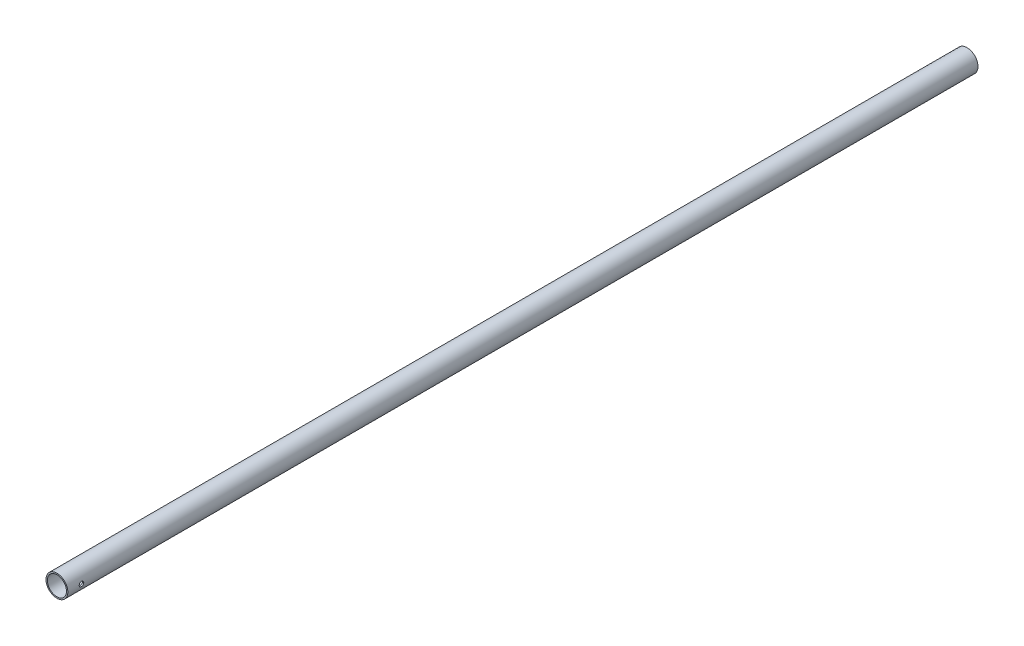
ISO-10303-21;
HEADER;
FILE_DESCRIPTION(('STEP AP214'),'2;1');
FILE_NAME('part.step','',(''),(''),'','','');
FILE_SCHEMA(('AUTOMOTIVE_DESIGN { 1 0 10303 214 1 1 1 1 }'));
ENDSEC;
DATA;
#1=APPLICATION_CONTEXT('core data for automotive mechanical design processes');
#2=APPLICATION_PROTOCOL_DEFINITION('international standard','automotive_design',2000,#1);
#3=PRODUCT_CONTEXT('',#1,'mechanical');
#4=PRODUCT('Part','Part','',(#3));
#5=PRODUCT_RELATED_PRODUCT_CATEGORY('part','',(#4));
#6=PRODUCT_DEFINITION_FORMATION('','',#4);
#7=PRODUCT_DEFINITION_CONTEXT('part definition',#1,'design');
#8=PRODUCT_DEFINITION('design','',#6,#7);
#9=PRODUCT_DEFINITION_SHAPE('','',#8);
#10=(LENGTH_UNIT() NAMED_UNIT(*) SI_UNIT(.MILLI.,.METRE.));
#11=(NAMED_UNIT(*) PLANE_ANGLE_UNIT() SI_UNIT($,.RADIAN.));
#12=(NAMED_UNIT(*) SI_UNIT($,.STERADIAN.) SOLID_ANGLE_UNIT());
#13=UNCERTAINTY_MEASURE_WITH_UNIT(LENGTH_MEASURE(1.E-05),#10,'distance_accuracy_value','');
#14=(GEOMETRIC_REPRESENTATION_CONTEXT(3) GLOBAL_UNCERTAINTY_ASSIGNED_CONTEXT((#13)) GLOBAL_UNIT_ASSIGNED_CONTEXT((#10,
#11,#12)) REPRESENTATION_CONTEXT('',''));
#15=CARTESIAN_POINT('',(0.,0.,0.));
#16=DIRECTION('',(0.,0.,1.));
#17=DIRECTION('',(1.,0.,0.));
#18=AXIS2_PLACEMENT_3D('',#15,#16,#17);
#19=CARTESIAN_POINT('',(0.,0.,2000.));
#20=DIRECTION('',(0.,0.,1.));
#21=DIRECTION('',(1.,0.,0.));
#22=AXIS2_PLACEMENT_3D('',#19,#20,#21);
#23=PLANE('',#22);
#24=CARTESIAN_POINT('',(0.,0.,2000.));
#25=DIRECTION('',(0.,0.,1.));
#26=DIRECTION('',(1.,0.,0.));
#27=AXIS2_PLACEMENT_3D('',#24,#25,#26);
#28=CIRCLE('',#27,24.);
#29=CARTESIAN_POINT('',(24.,0.,2000.));
#30=VERTEX_POINT('',#29);
#31=EDGE_CURVE('E86',#30,#30,#28,.T.);
#32=ORIENTED_EDGE('',*,*,#31,.T.);
#33=EDGE_LOOP('',(#32));
#34=FACE_BOUND('',#33,.T.);
#35=CARTESIAN_POINT('',(0.,0.,2000.));
#36=DIRECTION('',(0.,0.,1.));
#37=DIRECTION('',(1.,0.,0.));
#38=AXIS2_PLACEMENT_3D('',#35,#36,#37);
#39=CIRCLE('',#38,21.);
#40=CARTESIAN_POINT('',(21.,0.,2000.));
#41=VERTEX_POINT('',#40);
#42=EDGE_CURVE('E143',#41,#41,#39,.T.);
#43=ORIENTED_EDGE('',*,*,#42,.F.);
#44=EDGE_LOOP('',(#43));
#45=FACE_BOUND('',#44,.T.);
#46=ADVANCED_FACE('F43',(#34,#45),#23,.T.);
#47=CARTESIAN_POINT('',(0.,0.,0.));
#48=DIRECTION('',(0.,0.,1.));
#49=DIRECTION('',(1.,0.,0.));
#50=AXIS2_PLACEMENT_3D('',#47,#48,#49);
#51=PLANE('',#50);
#52=CARTESIAN_POINT('',(0.,0.,0.));
#53=DIRECTION('',(0.,0.,1.));
#54=DIRECTION('',(1.,0.,0.));
#55=AXIS2_PLACEMENT_3D('',#52,#53,#54);
#56=CIRCLE('',#55,24.);
#57=CARTESIAN_POINT('',(24.,0.,0.));
#58=VERTEX_POINT('',#57);
#59=EDGE_CURVE('E147',#58,#58,#56,.T.);
#60=ORIENTED_EDGE('',*,*,#59,.F.);
#61=EDGE_LOOP('',(#60));
#62=FACE_BOUND('',#61,.T.);
#63=CARTESIAN_POINT('',(0.,0.,0.));
#64=DIRECTION('',(0.,0.,1.));
#65=DIRECTION('',(1.,0.,0.));
#66=AXIS2_PLACEMENT_3D('',#63,#64,#65);
#67=CIRCLE('',#66,21.);
#68=CARTESIAN_POINT('',(21.,0.,0.));
#69=VERTEX_POINT('',#68);
#70=EDGE_CURVE('E141',#69,#69,#67,.T.);
#71=ORIENTED_EDGE('',*,*,#70,.T.);
#72=EDGE_LOOP('',(#71));
#73=FACE_BOUND('',#72,.T.);
#74=ADVANCED_FACE('F158',(#62,#73),#51,.F.);
#75=CARTESIAN_POINT('',(0.,0.,2000.));
#76=DIRECTION('',(0.,0.,-1.));
#77=DIRECTION('',(-1.,0.,0.));
#78=AXIS2_PLACEMENT_3D('',#75,#76,#77);
#79=CYLINDRICAL_SURFACE('',#78,24.);
#80=CARTESIAN_POINT('',(-24.,0.,1965.));
#81=CARTESIAN_POINT('',(-23.999994861066,0.277636166806643,1965.00000990988));
#82=CARTESIAN_POINT('',(-23.9951331510017,0.555395158083505,1965.02320266287));
#83=CARTESIAN_POINT('',(-23.9762080396272,1.10304526506798,1965.11527739813));
#84=CARTESIAN_POINT('',(-23.9621376475701,1.37293024051326,1965.18419409215));
#85=CARTESIAN_POINT('',(-23.9263643678479,1.89683652916537,1965.36548181969));
#86=CARTESIAN_POINT('',(-23.9046690821052,2.15087334683674,1965.477809584));
#87=CARTESIAN_POINT('',(-23.8559971123949,2.63648131442384,1965.74259843542));
#88=CARTESIAN_POINT('',(-23.8290206650411,2.86805347013733,1965.89505772462));
#89=CARTESIAN_POINT('',(-23.7723080009839,3.30556129723536,1966.23814536076));
#90=CARTESIAN_POINT('',(-23.7425402339332,3.51112097665072,1966.42924800494));
#91=CARTESIAN_POINT('',(-23.683826307706,3.8875111070776,1966.84317863678));
#92=CARTESIAN_POINT('',(-23.6548802166974,4.05833868384405,1967.06600924749));
#93=CARTESIAN_POINT('',(-23.6007777037819,4.36204126708858,1967.53980787506));
#94=CARTESIAN_POINT('',(-23.575661806879,4.49452218722571,1967.79103353801));
#95=CARTESIAN_POINT('',(-23.5325136261149,4.71524477392288,1968.31278980709));
#96=CARTESIAN_POINT('',(-23.5144805791287,4.80349120670686,1968.58331832978));
#97=CARTESIAN_POINT('',(-23.4878600390246,4.93200960535034,1969.13194094966));
#98=CARTESIAN_POINT('',(-23.4791422726772,4.97294390787021,1969.40987343732));
#99=CARTESIAN_POINT('',(-23.4717476271059,5.00773430622259,1969.96878737143));
#100=CARTESIAN_POINT('',(-23.4730696316259,5.0015956357878,1970.24976847545));
#101=CARTESIAN_POINT('',(-23.4854869731733,4.94294876148851,1970.8019241119));
#102=CARTESIAN_POINT('',(-23.4964213473049,4.89120420930899,1971.07318391865));
#103=CARTESIAN_POINT('',(-23.5265775045288,4.74402174119767,1971.60308603858));
#104=CARTESIAN_POINT('',(-23.5457997136234,4.64858157925525,1971.86172770243));
#105=CARTESIAN_POINT('',(-23.5905276585936,4.41600012855722,1972.36122891366));
#106=CARTESIAN_POINT('',(-23.6160781514313,4.27856010136955,1972.60194518611));
#107=CARTESIAN_POINT('',(-23.6705556004209,3.96609079709935,1973.05718297707));
#108=CARTESIAN_POINT('',(-23.6994829759393,3.79105684905042,1973.27170123534));
#109=CARTESIAN_POINT('',(-23.7581492371985,3.40429968618721,1973.67285584432));
#110=CARTESIAN_POINT('',(-23.7878929279795,3.19192573364843,1973.85886467559));
#111=CARTESIAN_POINT('',(-23.8443235257194,2.73866915444729,1974.19272176892));
#112=CARTESIAN_POINT('',(-23.8710103868093,2.49778610010313,1974.34056945839));
#113=CARTESIAN_POINT('',(-23.9183948377128,1.99362216494197,1974.59404032614));
#114=CARTESIAN_POINT('',(-23.9390815884104,1.73030184770608,1974.69958721827));
#115=CARTESIAN_POINT('',(-23.9720535284512,1.18913848388871,1974.86476681934));
#116=CARTESIAN_POINT('',(-23.9843398238421,0.911297354380439,1974.92440557293));
#117=CARTESIAN_POINT('',(-23.9989710086182,0.354367462803405,1974.99517700827));
#118=CARTESIAN_POINT('',(-24.0014917415031,0.0753922221047726,1975.00716776598));
#119=CARTESIAN_POINT('',(-23.996798090111,-0.480575195030815,1974.98462020012));
#120=CARTESIAN_POINT('',(-23.9895843019263,-0.757567491848998,1974.95008472559));
#121=CARTESIAN_POINT('',(-23.9663425991672,-1.29890546847923,1974.83617738612));
#122=CARTESIAN_POINT('',(-23.9504021147226,-1.56334877157681,1974.75725005847));
#123=CARTESIAN_POINT('',(-23.9114890896963,-2.07524578664535,1974.55728855831));
#124=CARTESIAN_POINT('',(-23.8885159897851,-2.32269814534715,1974.43625103654));
#125=CARTESIAN_POINT('',(-23.8376496596266,-2.79717722777394,1974.15367848705));
#126=CARTESIAN_POINT('',(-23.8096957524857,-3.02389287787918,1973.99163228172));
#127=CARTESIAN_POINT('',(-23.7521027319958,-3.44722178354609,1973.63232174769));
#128=CARTESIAN_POINT('',(-23.7224634217284,-3.64383151165344,1973.43505329792));
#129=CARTESIAN_POINT('',(-23.6642409812267,-4.00471459460678,1973.006977692));
#130=CARTESIAN_POINT('',(-23.6356835721933,-4.16839658400671,1972.77566787218));
#131=CARTESIAN_POINT('',(-23.583424040739,-4.45458876317108,1972.28833486314));
#132=CARTESIAN_POINT('',(-23.5597217161846,-4.57710066711974,1972.03231270343));
#133=CARTESIAN_POINT('',(-23.5200680279248,-4.77668985775425,1971.50415521482));
#134=CARTESIAN_POINT('',(-23.5040749099111,-4.85401239310595,1971.23211585139));
#135=CARTESIAN_POINT('',(-23.4815673870731,-4.9617615409213,1970.67853379809));
#136=CARTESIAN_POINT('',(-23.4750516263408,-4.99219486177552,1970.39699247355));
#137=CARTESIAN_POINT('',(-23.4723162924127,-5.00503705950647,1969.83834639598));
#138=CARTESIAN_POINT('',(-23.4758960918834,-4.98838170490298,1969.56126371908));
#139=CARTESIAN_POINT('',(-23.4924978890277,-4.90959621255372,1969.01394396429));
#140=CARTESIAN_POINT('',(-23.5055197960719,-4.84746651128968,1968.74370682073));
#141=CARTESIAN_POINT('',(-23.5394452982205,-4.67992871074608,1968.21840891245));
#142=CARTESIAN_POINT('',(-23.5603262804008,-4.57464470273756,1967.96330701405));
#143=CARTESIAN_POINT('',(-23.6076282294659,-4.3238982919896,1967.47424489589));
#144=CARTESIAN_POINT('',(-23.6340497105958,-4.17843215932108,1967.24028664147));
#145=CARTESIAN_POINT('',(-23.6900631820688,-3.84829478136993,1966.79551349168));
#146=CARTESIAN_POINT('',(-23.7197045547423,-3.662951561673,1966.58520350174));
#147=CARTESIAN_POINT('',(-23.7784735833223,-3.25969775246124,1966.19836202709));
#148=CARTESIAN_POINT('',(-23.8076011193935,-3.04177967533178,1966.02183832979));
#149=CARTESIAN_POINT('',(-23.8624577819072,-2.57653771003074,1965.70564570726));
#150=CARTESIAN_POINT('',(-23.8881438429302,-2.32890368608535,1965.56642528045));
#151=CARTESIAN_POINT('',(-23.9327963397633,-1.81327937599381,1965.33179908628));
#152=CARTESIAN_POINT('',(-23.9517686472839,-1.54530712762898,1965.23635501127));
#153=CARTESIAN_POINT('',(-23.9772999912578,-1.06406117160044,1965.10983888685));
#154=CARTESIAN_POINT('',(-23.9857614264558,-0.85347037491175,1965.06872494716));
#155=CARTESIAN_POINT('',(-23.9971133115903,-0.428610696706178,1965.01380218289));
#156=CARTESIAN_POINT('',(-24.0000039673834,-0.214341951395503,1964.99999234933));
#157=CARTESIAN_POINT('',(-24.,0.,1965.));
#158=B_SPLINE_CURVE_WITH_KNOTS('',3,(#80,#81,#82,#83,#84,#85,#86,#87,#88,#89,#90,#91,#92,#93,
#94,#95,#96,#97,#98,#99,#100,#101,#102,#103,#104,#105,#106,#107,#108,#109,#110,#111,#112,#113,
#114,#115,#116,#117,#118,#119,#120,#121,#122,#123,#124,#125,#126,#127,#128,#129,#130,#131,#132,
#133,#134,#135,#136,#137,#138,#139,#140,#141,#142,#143,#144,#145,#146,#147,#148,#149,#150,#151,
#152,#153,#154,#155,#156,#157),.UNSPECIFIED.,.T.,.F.,(4,2,2,2,2,2,2,2,2,2,2,2,2,2,2,2,2,2,2,2,2,
2,2,2,2,2,2,2,2,2,2,2,2,2,2,2,2,2,4),(0.,0.832124180412729,1.66488079962489,2.4968095153018,
3.32870096629195,4.1715010555248,5.01437086207161,5.86561796714188,6.71677333141967,
7.55586300682109,8.39485939074104,9.22006848521691,10.0453200012658,10.8765836967242,
11.7079507347759,12.5555810542731,13.4032240911832,14.252388980041,15.1014420418853,
15.9351335763615,16.7687740621456,17.5942114653594,18.4197145356919,19.256063359884,
20.0925101026374,20.9428505532278,21.7931555941069,22.6388020038771,23.4843274166671,
24.3131689317594,25.14200249139,25.9684692558656,26.7950127633945,27.6367609933478,
28.4787030048304,29.3303545760657,30.1812594587343,30.8237035392266,31.4661238790711),.UNSPECIFIED.);
#159=CARTESIAN_POINT('',(-24.,0.,1965.));
#160=VERTEX_POINT('',#159);
#161=EDGE_CURVE('E11',#160,#160,#158,.T.);
#162=ORIENTED_EDGE('',*,*,#161,.T.);
#163=EDGE_LOOP('',(#162));
#164=FACE_BOUND('',#163,.T.);
#165=CARTESIAN_POINT('',(23.975,-1.09515980569044,1965.12141157711));
#166=CARTESIAN_POINT('',(23.968748365967,-1.23224681427325,1965.15216920839));
#167=CARTESIAN_POINT('',(23.9613601734638,-1.36797282869042,1965.18872171484));
#168=CARTESIAN_POINT('',(23.9445654413173,-1.63574004655299,1965.27305470961));
#169=CARTESIAN_POINT('',(23.9351592198603,-1.76778182719347,1965.32083342799));
#170=CARTESIAN_POINT('',(23.9145941212787,-2.02709697468056,1965.42719949035));
#171=CARTESIAN_POINT('',(23.9034374824825,-2.15437617766581,1965.48577304703));
#172=CARTESIAN_POINT('',(23.8796771678721,-2.40346918084593,1965.61332555548));
#173=CARTESIAN_POINT('',(23.8670734668173,-2.52528288565628,1965.68230468877));
#174=CARTESIAN_POINT('',(23.8407708851503,-2.76258883052472,1965.83015074795));
#175=CARTESIAN_POINT('',(23.8270722558788,-2.87808251114835,1965.90901540696));
#176=CARTESIAN_POINT('',(23.7989505375895,-3.10204732689315,1966.07612045677));
#177=CARTESIAN_POINT('',(23.7845271826325,-3.21051585020611,1966.1643643027));
#178=CARTESIAN_POINT('',(23.7553631312298,-3.41962961918388,1966.34957057225));
#179=CARTESIAN_POINT('',(23.7406225313502,-3.52027720363007,1966.44653037058));
#180=CARTESIAN_POINT('',(23.7112221066012,-3.71314801958655,1966.64857574588));
#181=CARTESIAN_POINT('',(23.6965623137583,-3.8053681090141,1966.75366432683));
#182=CARTESIAN_POINT('',(23.6675871380506,-3.98163051804368,1966.97236926516));
#183=CARTESIAN_POINT('',(23.6532769315573,-4.06557767589029,1967.08606303196));
#184=CARTESIAN_POINT('',(23.6255674141578,-4.22362477899513,1967.3202688813));
#185=CARTESIAN_POINT('',(23.6121684452334,-4.2977210371257,1967.44078349291));
#186=CARTESIAN_POINT('',(23.5866814034978,-4.43546698124717,1967.68772525304));
#187=CARTESIAN_POINT('',(23.5745929155034,-4.4991199791453,1967.81415051069));
#188=CARTESIAN_POINT('',(23.5520748615044,-4.61554865115295,1968.07211447572));
#189=CARTESIAN_POINT('',(23.5416458997194,-4.66832036553766,1968.20365502393));
#190=CARTESIAN_POINT('',(23.5228357644798,-4.76219212213002,1968.46987006394));
#191=CARTESIAN_POINT('',(23.5144398749696,-4.80337641290026,1968.60451380235));
#192=CARTESIAN_POINT('',(23.4998449270079,-4.87427953070888,1968.87695975557));
#193=CARTESIAN_POINT('',(23.4936466943985,-4.90399404797279,1969.01476313706));
#194=CARTESIAN_POINT('',(23.4836428775968,-4.95167764236373,1969.29238851196));
#195=CARTESIAN_POINT('',(23.4798358610234,-4.969653751263,1969.43220924549));
#196=CARTESIAN_POINT('',(23.4747241238061,-4.99374409457383,1969.71297886353));
#197=CARTESIAN_POINT('',(23.4734205226039,-4.99985302240177,1969.85392822444));
#198=CARTESIAN_POINT('',(23.4733595795833,-5.00013888192353,1970.13304626217));
#199=CARTESIAN_POINT('',(23.4745523411448,-4.99454963352743,1970.27121474802));
#200=CARTESIAN_POINT('',(23.4793482060551,-4.97195544148962,1970.5465728709));
#201=CARTESIAN_POINT('',(23.4829513037698,-4.95495052453156,1970.68376251023));
#202=CARTESIAN_POINT('',(23.4924628224408,-4.90965629330215,1970.95621685878));
#203=CARTESIAN_POINT('',(23.4983717836212,-4.88136433463625,1971.09148110922));
#204=CARTESIAN_POINT('',(23.5123197416485,-4.81373145239337,1971.35905305348));
#205=CARTESIAN_POINT('',(23.5203579743977,-4.77439449205653,1971.49136178948));
#206=CARTESIAN_POINT('',(23.5383265691202,-4.6850034294787,1971.75206093542));
#207=CARTESIAN_POINT('',(23.5482554891296,-4.63495749104074,1971.88045424551));
#208=CARTESIAN_POINT('',(23.5697234201822,-4.5245219431463,1972.13251678563));
#209=CARTESIAN_POINT('',(23.5812618647075,-4.4641359714633,1972.25618765844));
#210=CARTESIAN_POINT('',(23.6056327675501,-4.3334190847166,1972.49807622108));
#211=CARTESIAN_POINT('',(23.6184656599759,-4.26308483017468,1972.61629206199));
#212=CARTESIAN_POINT('',(23.6450634771198,-4.11300098065095,1972.84641665178));
#213=CARTESIAN_POINT('',(23.65882808282,-4.03325460148688,1972.95832753565));
#214=CARTESIAN_POINT('',(23.6871916654114,-3.8632266810926,1973.17727271514));
#215=CARTESIAN_POINT('',(23.7018016544165,-3.77277062825404,1973.28417010915));
#216=CARTESIAN_POINT('',(23.7311908564335,-3.58326236986886,1973.48995555639));
#217=CARTESIAN_POINT('',(23.7459700083992,-3.48421318541332,1973.58884640104));
#218=CARTESIAN_POINT('',(23.7752993016186,-3.2781061773565,1973.77804146561));
#219=CARTESIAN_POINT('',(23.7898493291479,-3.17104451959973,1973.8683415271));
#220=CARTESIAN_POINT('',(23.8183047786326,-2.94971216993621,1974.03965047777));
#221=CARTESIAN_POINT('',(23.8322104282647,-2.83544405848619,1974.12066266376));
#222=CARTESIAN_POINT('',(23.8596726446446,-2.59450286370421,1974.27670155474));
#223=CARTESIAN_POINT('',(23.8731763476037,-2.46749485580766,1974.35122123247));
#224=CARTESIAN_POINT('',(23.8986406452392,-2.2072779948441,1974.48882960422));
#225=CARTESIAN_POINT('',(23.9106011940913,-2.07406895779523,1974.5519179588));
#226=CARTESIAN_POINT('',(23.9326247679846,-1.8022346207608,1974.66623101899));
#227=CARTESIAN_POINT('',(23.9426845745331,-1.66360060538403,1974.71743563496));
#228=CARTESIAN_POINT('',(23.960583497083,-1.38220111345897,1974.80743139323));
#229=CARTESIAN_POINT('',(23.968422301542,-1.2394350603977,1974.84622079413));
#230=CARTESIAN_POINT('',(23.975,-1.09515980569042,1974.87858842289));
#231=B_SPLINE_CURVE_WITH_KNOTS('',3,(#165,#166,#167,#168,#169,#170,#171,#172,#173,#174,#175,
#176,#177,#178,#179,#180,#181,#182,#183,#184,#185,#186,#187,#188,#189,#190,#191,#192,#193,#194,
#195,#196,#197,#198,#199,#200,#201,#202,#203,#204,#205,#206,#207,#208,#209,#210,#211,#212,#213,
#214,#215,#216,#217,#218,#219,#220,#221,#222,#223,#224,#225,#226,#227,#228,#229,#230),
.UNSPECIFIED.,.F.,.F.,(4,2,2,2,2,2,2,2,2,2,2,2,2,2,2,2,2,2,2,2,2,2,2,2,2,2,2,2,2,2,2,2,4),(0.,
0.421760901676002,0.84345535236266,1.26461489570341,1.68578178631253,2.10685227419139,
2.5280784192516,2.94917811175478,3.37043417070609,3.79607706774015,4.2218788342848,
4.64754530272413,5.07336639988133,5.49600638335769,5.91880501983602,6.34135015024872,
6.76408418444385,7.17844948311008,7.59281381321766,8.00727528010285,8.42158821684135,
8.83558642744392,9.24943928561354,9.66343139868479,10.0772824713313,10.4991701992624,
10.9209102003878,11.3428533204622,11.7646462014488,12.2076847770848,12.6507365058727,
13.0945318516913,13.538389418388),.UNSPECIFIED.);
#232=CARTESIAN_POINT('',(23.975,-1.09515980569042,1965.12141157711));
#233=VERTEX_POINT('',#232);
#234=CARTESIAN_POINT('',(23.975,-1.09515980569044,1974.87858842289));
#235=VERTEX_POINT('',#234);
#236=EDGE_CURVE('E90',#233,#235,#231,.T.);
#237=ORIENTED_EDGE('',*,*,#236,.T.);
#238=CARTESIAN_POINT('',(23.9723,-1.15275006397729,1974.8625275917));
#239=CARTESIAN_POINT('',(23.9781392979474,-1.03154200004675,1974.89728031993));
#240=CARTESIAN_POINT('',(23.9831134949393,-0.908722912885051,1974.92659818002));
#241=CARTESIAN_POINT('',(23.9912178521535,-0.660841262552903,1974.97409306981));
#242=CARTESIAN_POINT('',(23.9943472947677,-0.535777845807257,1974.99226576416));
#243=CARTESIAN_POINT('',(23.9985897867272,-0.287628883946799,1975.01685987648));
#244=CARTESIAN_POINT('',(23.999751375024,-0.16457225238678,1975.02356421408));
#245=CARTESIAN_POINT('',(24.0001768933379,0.0815889435704667,1975.02602144756));
#246=CARTESIAN_POINT('',(23.999441771824,0.204693453243416,1975.0217798171));
#247=CARTESIAN_POINT('',(23.9958746756669,0.466007863142393,1975.00113365024));
#248=CARTESIAN_POINT('',(23.9927820167069,0.604096403452712,1974.98321661937));
#249=CARTESIAN_POINT('',(23.984277492486,0.879740226087355,1974.93344397685));
#250=CARTESIAN_POINT('',(23.978832635716,1.01725871608325,1974.90138994307));
#251=CARTESIAN_POINT('',(23.9723,1.15275006397727,1974.8625275917));
#252=B_SPLINE_CURVE_WITH_KNOTS('',3,(#238,#239,#240,#241,#242,#243,#244,#245,#246,#247,#248,
#249,#250,#251),.UNSPECIFIED.,.F.,.F.,(4,2,2,2,2,2,4),(0.,0.378569501850084,0.757286169971352,
1.12651760805407,1.49556444401623,1.91268749018455,2.33586129937914),.UNSPECIFIED.);
#253=CARTESIAN_POINT('',(23.975,1.09515980569044,1974.87858842289));
#254=VERTEX_POINT('',#253);
#255=EDGE_CURVE('E59',#235,#254,#252,.T.);
#256=ORIENTED_EDGE('',*,*,#255,.T.);
#257=CARTESIAN_POINT('',(23.975,1.09515980569044,1974.87858842289));
#258=CARTESIAN_POINT('',(23.968748365967,1.23224681427325,1974.84783079161));
#259=CARTESIAN_POINT('',(23.9613601734638,1.36797282869042,1974.81127828516));
#260=CARTESIAN_POINT('',(23.9445654413173,1.63574004655299,1974.72694529039));
#261=CARTESIAN_POINT('',(23.9351592198603,1.76778182719347,1974.67916657201));
#262=CARTESIAN_POINT('',(23.9145941212787,2.02709697468056,1974.57280050965));
#263=CARTESIAN_POINT('',(23.9034374824825,2.15437617766582,1974.51422695297));
#264=CARTESIAN_POINT('',(23.8796771678721,2.40346918084593,1974.38667444452));
#265=CARTESIAN_POINT('',(23.8670734668173,2.52528288565627,1974.31769531123));
#266=CARTESIAN_POINT('',(23.8407708851503,2.76258883052468,1974.16984925205));
#267=CARTESIAN_POINT('',(23.8270722558788,2.8780825111483,1974.09098459304));
#268=CARTESIAN_POINT('',(23.7989505375895,3.1020473268931,1973.92387954323));
#269=CARTESIAN_POINT('',(23.7845271826325,3.21051585020606,1973.83563569729));
#270=CARTESIAN_POINT('',(23.7553631312298,3.41962961918397,1973.65042942775));
#271=CARTESIAN_POINT('',(23.7406225313502,3.5202772036303,1973.55346962942));
#272=CARTESIAN_POINT('',(23.7112221066011,3.71314801958678,1973.35142425412));
#273=CARTESIAN_POINT('',(23.6965623137583,3.8053681090142,1973.24633567317));
#274=CARTESIAN_POINT('',(23.6675871380506,3.9816305180437,1973.02763073484));
#275=CARTESIAN_POINT('',(23.6532769315573,4.06557767589035,1972.91393696804));
#276=CARTESIAN_POINT('',(23.6255674141578,4.22362477899518,1972.6797311187));
#277=CARTESIAN_POINT('',(23.6121684452334,4.29772103712571,1972.55921650709));
#278=CARTESIAN_POINT('',(23.5866814034978,4.4354669812472,1972.31227474696));
#279=CARTESIAN_POINT('',(23.5745929155034,4.49911997914539,1972.18584948931));
#280=CARTESIAN_POINT('',(23.5520748615044,4.61554865115303,1971.92788552428));
#281=CARTESIAN_POINT('',(23.5416458997194,4.66832036553768,1971.79634497607));
#282=CARTESIAN_POINT('',(23.5228357644798,4.7621921221301,1971.53012993606));
#283=CARTESIAN_POINT('',(23.5144398749696,4.80337641290042,1971.39548619765));
#284=CARTESIAN_POINT('',(23.4998449270078,4.87427953070906,1971.12304024443));
#285=CARTESIAN_POINT('',(23.4936466943985,4.90399404797293,1970.98523686294));
#286=CARTESIAN_POINT('',(23.4836428775968,4.95167764236381,1970.70761148804));
#287=CARTESIAN_POINT('',(23.4798358610234,4.96965375126306,1970.56779075451));
#288=CARTESIAN_POINT('',(23.4747241238061,4.99374409457384,1970.28702113647));
#289=CARTESIAN_POINT('',(23.4734205226039,4.99985302240177,1970.14607177556));
#290=CARTESIAN_POINT('',(23.4733595795833,5.00013888192353,1969.86695373783));
#291=CARTESIAN_POINT('',(23.4745523411448,4.99454963352741,1969.72878525198));
#292=CARTESIAN_POINT('',(23.4793482060551,4.97195544148958,1969.4534271291));
#293=CARTESIAN_POINT('',(23.4829513037698,4.95495052453154,1969.31623748977));
#294=CARTESIAN_POINT('',(23.4924628224408,4.90965629330218,1969.04378314122));
#295=CARTESIAN_POINT('',(23.4983717836212,4.88136433463634,1968.90851889078));
#296=CARTESIAN_POINT('',(23.5123197416485,4.81373145239349,1968.64094694652));
#297=CARTESIAN_POINT('',(23.5203579743977,4.7743944920566,1968.50863821052));
#298=CARTESIAN_POINT('',(23.5383265691202,4.6850034294787,1968.24793906458));
#299=CARTESIAN_POINT('',(23.5482554891296,4.63495749104074,1968.11954575449));
#300=CARTESIAN_POINT('',(23.5697234201822,4.52452194314631,1967.86748321437));
#301=CARTESIAN_POINT('',(23.5812618647075,4.46413597146331,1967.74381234156));
#302=CARTESIAN_POINT('',(23.60563276755,4.33341908471663,1967.50192377892));
#303=CARTESIAN_POINT('',(23.6184656599759,4.26308483017473,1967.38370793801));
#304=CARTESIAN_POINT('',(23.6450634771198,4.113000980651,1967.15358334822));
#305=CARTESIAN_POINT('',(23.65882808282,4.03325460148691,1967.04167246435));
#306=CARTESIAN_POINT('',(23.6871916654114,3.86322668109264,1966.82272728486));
#307=CARTESIAN_POINT('',(23.7018016544165,3.77277062825413,1966.71582989085));
#308=CARTESIAN_POINT('',(23.7311908564335,3.58326236986895,1966.51004444361));
#309=CARTESIAN_POINT('',(23.7459700083992,3.48421318541336,1966.41115359896));
#310=CARTESIAN_POINT('',(23.7752993016186,3.27810617735649,1966.22195853439));
#311=CARTESIAN_POINT('',(23.7898493291479,3.17104451959973,1966.1316584729));
#312=CARTESIAN_POINT('',(23.8183047786326,2.94971216993622,1965.96034952223));
#313=CARTESIAN_POINT('',(23.8322104282647,2.83544405848619,1965.87933733624));
#314=CARTESIAN_POINT('',(23.8596726446447,2.59450286370418,1965.72329844526));
#315=CARTESIAN_POINT('',(23.8731763476037,2.4674948558076,1965.64877876753));
#316=CARTESIAN_POINT('',(23.8986406452392,2.20727799484403,1965.51117039578));
#317=CARTESIAN_POINT('',(23.9106011940913,2.0740689577952,1965.4480820412));
#318=CARTESIAN_POINT('',(23.9326247679846,1.8022346207608,1965.33376898101));
#319=CARTESIAN_POINT('',(23.9426845745331,1.66360060538404,1965.28256436504));
#320=CARTESIAN_POINT('',(23.960583497083,1.38220111345897,1965.19256860677));
#321=CARTESIAN_POINT('',(23.968422301542,1.23943506039769,1965.15377920587));
#322=CARTESIAN_POINT('',(23.975,1.09515980569042,1965.12141157711));
#323=B_SPLINE_CURVE_WITH_KNOTS('',3,(#257,#258,#259,#260,#261,#262,#263,#264,#265,#266,#267,
#268,#269,#270,#271,#272,#273,#274,#275,#276,#277,#278,#279,#280,#281,#282,#283,#284,#285,#286,
#287,#288,#289,#290,#291,#292,#293,#294,#295,#296,#297,#298,#299,#300,#301,#302,#303,#304,#305,
#306,#307,#308,#309,#310,#311,#312,#313,#314,#315,#316,#317,#318,#319,#320,#321,#322),
.UNSPECIFIED.,.F.,.F.,(4,2,2,2,2,2,2,2,2,2,2,2,2,2,2,2,2,2,2,2,2,2,2,2,2,2,2,2,2,2,2,2,4),(0.,
0.421760901676002,0.84345535236266,1.26461489570341,1.68578178631253,2.10685227419118,
2.5280784192516,2.94917811175518,3.37043417070611,3.7960770677404,4.22187883428481,
4.64754530272418,5.07336639988134,5.49600638335862,5.91880501983671,6.34135015024919,
6.76408418444387,7.17844948311054,7.59281381321768,8.00727528010218,8.42158821684136,
8.83558642744394,9.24943928561355,9.66343139868457,10.0772824713313,10.4991701992623,
10.9209102003878,11.3428533204623,11.7646462014489,12.2076847770849,12.6507365058727,
13.0945318516913,13.538389418388),.UNSPECIFIED.);
#324=CARTESIAN_POINT('',(23.975,1.09515980569044,1965.12141157711));
#325=VERTEX_POINT('',#324);
#326=EDGE_CURVE('E85',#254,#325,#323,.T.);
#327=ORIENTED_EDGE('',*,*,#326,.T.);
#328=CARTESIAN_POINT('',(23.9723,1.15275006397728,1965.1374724083));
#329=CARTESIAN_POINT('',(23.9781392979474,1.03154200004673,1965.10271968007));
#330=CARTESIAN_POINT('',(23.9831134949393,0.908722912885039,1965.07340181998));
#331=CARTESIAN_POINT('',(23.9912178521535,0.660841262552891,1965.02590693019));
#332=CARTESIAN_POINT('',(23.9943472947677,0.535777845807244,1965.00773423584));
#333=CARTESIAN_POINT('',(23.9985897867272,0.287628883946785,1964.98314012352));
#334=CARTESIAN_POINT('',(23.999751375024,0.164572252386767,1964.97643578592));
#335=CARTESIAN_POINT('',(24.0001768933379,-0.0815889435704807,1964.97397855244));
#336=CARTESIAN_POINT('',(23.999441771824,-0.20469345324343,1964.9782201829));
#337=CARTESIAN_POINT('',(23.9958746756669,-0.466007863142407,1964.99886634976));
#338=CARTESIAN_POINT('',(23.9927820167069,-0.604096403452725,1965.01678338063));
#339=CARTESIAN_POINT('',(23.984277492486,-0.879740226087367,1965.06655602315));
#340=CARTESIAN_POINT('',(23.978832635716,-1.01725871608327,1965.09861005693));
#341=CARTESIAN_POINT('',(23.9723,-1.15275006397728,1965.1374724083));
#342=B_SPLINE_CURVE_WITH_KNOTS('',3,(#328,#329,#330,#331,#332,#333,#334,#335,#336,#337,#338,
#339,#340,#341),.UNSPECIFIED.,.F.,.F.,(4,2,2,2,2,2,4),(0.,0.378569501850083,0.757286169971352,
1.12651760805407,1.49556444401623,1.91268749018455,2.33586129937914),.UNSPECIFIED.);
#343=EDGE_CURVE('E79',#325,#233,#342,.T.);
#344=ORIENTED_EDGE('',*,*,#343,.T.);
#345=EDGE_LOOP('',(#237,#256,#327,#344));
#346=FACE_BOUND('',#345,.T.);
#347=ORIENTED_EDGE('',*,*,#31,.F.);
#348=EDGE_LOOP('',(#347));
#349=FACE_BOUND('',#348,.T.);
#350=ORIENTED_EDGE('',*,*,#59,.T.);
#351=EDGE_LOOP('',(#350));
#352=FACE_BOUND('',#351,.T.);
#353=ADVANCED_FACE('F45',(#164,#346,#349,#352),#79,.T.);
#354=CARTESIAN_POINT('',(0.,0.,2000.));
#355=DIRECTION('',(0.,0.,-1.));
#356=DIRECTION('',(-1.,0.,0.));
#357=AXIS2_PLACEMENT_3D('',#354,#355,#356);
#358=CYLINDRICAL_SURFACE('',#357,21.);
#359=CARTESIAN_POINT('',(-21.,0.,1975.));
#360=CARTESIAN_POINT('',(-20.9999950869177,-0.276672274558169,1974.99999151638));
#361=CARTESIAN_POINT('',(-20.9944774067901,-0.553442219138292,1974.97695835107));
#362=CARTESIAN_POINT('',(-20.9730002170211,-1.09907770151532,1974.88555542657));
#363=CARTESIAN_POINT('',(-20.9570341804966,-1.36793818865574,1974.81715732844));
#364=CARTESIAN_POINT('',(-20.9164321233986,-1.88979410561493,1974.63732205476));
#365=CARTESIAN_POINT('',(-20.8918059875511,-2.1428072374909,1974.5259339344));
#366=CARTESIAN_POINT('',(-20.8365202410985,-2.6265522751158,1974.26344658075));
#367=CARTESIAN_POINT('',(-20.8058605663621,-2.85728394399264,1974.11234692535));
#368=CARTESIAN_POINT('',(-20.7412034300524,-3.29425969068973,1973.77172133021));
#369=CARTESIAN_POINT('',(-20.7071583727605,-3.50002481652155,1973.58158995483));
#370=CARTESIAN_POINT('',(-20.6398911908242,-3.87706759367376,1973.16959568724));
#371=CARTESIAN_POINT('',(-20.6066691512673,-4.04834169208969,1972.94772953006));
#372=CARTESIAN_POINT('',(-20.5443340852451,-4.35373775975632,1972.47491504958));
#373=CARTESIAN_POINT('',(-20.5152817169505,-4.48733420931327,1972.2236185684));
#374=CARTESIAN_POINT('',(-20.4652654141857,-4.71020659981248,1971.70133277819));
#375=CARTESIAN_POINT('',(-20.4443003177035,-4.79948890851929,1971.43034630495));
#376=CARTESIAN_POINT('',(-20.4133198403067,-4.92958478368451,1970.88161222288));
#377=CARTESIAN_POINT('',(-20.4031113241091,-4.97125443618189,1970.60407872751));
#378=CARTESIAN_POINT('',(-20.3942210083979,-5.00760694890757,1970.04578700015));
#379=CARTESIAN_POINT('',(-20.3955375175525,-5.00229670357487,1969.76502924737));
#380=CARTESIAN_POINT('',(-20.4093743902224,-4.94552551106825,1969.21474068758));
#381=CARTESIAN_POINT('',(-20.4216495933668,-4.89507437010485,1968.94509858684));
#382=CARTESIAN_POINT('',(-20.4556312820161,-4.75106000481967,1968.41821947882));
#383=CARTESIAN_POINT('',(-20.4773383834081,-4.65749396514329,1968.16098328286));
#384=CARTESIAN_POINT('',(-20.5279695490889,-4.42901918277296,1967.66345862417));
#385=CARTESIAN_POINT('',(-20.5569586210712,-4.29373539751999,1967.42334928213));
#386=CARTESIAN_POINT('',(-20.6188494651224,-3.98592814974477,1966.9688729448));
#387=CARTESIAN_POINT('',(-20.6517518623357,-3.81339873372293,1966.75451007346));
#388=CARTESIAN_POINT('',(-20.7188021758157,-3.43072154762634,1966.35181379647));
#389=CARTESIAN_POINT('',(-20.7529603394171,-3.21971896367644,1966.16429348113));
#390=CARTESIAN_POINT('',(-20.8179059217121,-2.76886002564414,1965.82715348547));
#391=CARTESIAN_POINT('',(-20.8486932553885,-2.52900294412995,1965.67753476097));
#392=CARTESIAN_POINT('',(-20.9035591483739,-2.02615010125808,1965.42018568342));
#393=CARTESIAN_POINT('',(-20.9276181213977,-1.76308965947613,1965.31257726981));
#394=CARTESIAN_POINT('',(-20.9661730935425,-1.22191581570755,1965.14332809925));
#395=CARTESIAN_POINT('',(-20.9806707472898,-0.943805027264924,1965.08167938854));
#396=CARTESIAN_POINT('',(-20.9982284084261,-0.387385657203806,1965.00731789326));
#397=CARTESIAN_POINT('',(-21.0015474704273,-0.1092331915776,1964.99349653781));
#398=CARTESIAN_POINT('',(-20.9971071082943,0.445408115725359,1965.01215573848));
#399=CARTESIAN_POINT('',(-20.9893485831105,0.721897090566621,1965.04463253748));
#400=CARTESIAN_POINT('',(-20.9637898453267,1.26158148309952,1965.15404991349));
#401=CARTESIAN_POINT('',(-20.9461242107755,1.52490459450505,1965.23039492018));
#402=CARTESIAN_POINT('',(-20.9027358040018,2.03499926473311,1965.42470890507));
#403=CARTESIAN_POINT('',(-20.8770122644598,2.28176924455399,1965.54268184746));
#404=CARTESIAN_POINT('',(-20.8197328931032,2.75623238417707,1965.81911465232));
#405=CARTESIAN_POINT('',(-20.7880882374493,2.98354580702723,1965.97820745184));
#406=CARTESIAN_POINT('',(-20.7226320711478,3.40864470182928,1966.33154544514));
#407=CARTESIAN_POINT('',(-20.6888202237635,3.606425569061,1966.5257961103));
#408=CARTESIAN_POINT('',(-20.6219225542402,3.97134130798887,1966.94906130527));
#409=CARTESIAN_POINT('',(-20.5888692989586,4.13770216924573,1967.17874933276));
#410=CARTESIAN_POINT('',(-20.5280730756898,4.42950564921563,1967.66344588259));
#411=CARTESIAN_POINT('',(-20.5003298700307,4.55495009947839,1967.91845327088));
#412=CARTESIAN_POINT('',(-20.4535871264968,4.76045016780837,1968.44515828517));
#413=CARTESIAN_POINT('',(-20.4345362583274,4.84077290916491,1968.7167469016));
#414=CARTESIAN_POINT('',(-20.4072662172575,4.95448974785942,1969.27008904823));
#415=CARTESIAN_POINT('',(-20.3990449342565,4.98789298735529,1969.55184058721));
#416=CARTESIAN_POINT('',(-20.3945149347173,5.00637908218325,1970.10966442718));
#417=CARTESIAN_POINT('',(-20.3979022602705,4.99269483015665,1970.38569408922));
#418=CARTESIAN_POINT('',(-20.4155111070867,4.92019018411218,1970.93139007434));
#419=CARTESIAN_POINT('',(-20.4297324484481,4.86137053957891,1971.201056503));
#420=CARTESIAN_POINT('',(-20.4672456928544,4.7009084644383,1971.72517347052));
#421=CARTESIAN_POINT('',(-20.4904928964589,4.59947686416728,1971.97969197272));
#422=CARTESIAN_POINT('',(-20.5434488063637,4.35684092769094,1972.46827066395));
#423=CARTESIAN_POINT('',(-20.5731583238631,4.21563159762342,1972.70232827941));
#424=CARTESIAN_POINT('',(-20.6365744262773,3.89349523609904,1973.14934702184));
#425=CARTESIAN_POINT('',(-20.6703592740924,3.7117034035977,1973.361673955));
#426=CARTESIAN_POINT('',(-20.7376300155849,3.3152748196271,1973.7532102363));
#427=CARTESIAN_POINT('',(-20.7711158373304,3.10063037919553,1973.93241180991));
#428=CARTESIAN_POINT('',(-20.8346538839906,2.64044421365956,1974.25538902123));
#429=CARTESIAN_POINT('',(-20.8646425758644,2.39446295766699,1974.39855175712));
#430=CARTESIAN_POINT('',(-20.9171515834915,1.8812448461283,1974.64126698756));
#431=CARTESIAN_POINT('',(-20.9396776146767,1.61402445241031,1974.74085287518));
#432=CARTESIAN_POINT('',(-20.9711168701525,1.12247311743839,1974.87761696161));
#433=CARTESIAN_POINT('',(-20.981876599935,0.900618617301301,1974.92341614766));
#434=CARTESIAN_POINT('',(-20.9963199559421,0.452531011495156,1974.98461019884));
#435=CARTESIAN_POINT('',(-21.0000040185508,0.226298176724317,1975.00000693899));
#436=CARTESIAN_POINT('',(-21.,0.,1975.));
#437=B_SPLINE_CURVE_WITH_KNOTS('',3,(#359,#360,#361,#362,#363,#364,#365,#366,#367,#368,#369,
#370,#371,#372,#373,#374,#375,#376,#377,#378,#379,#380,#381,#382,#383,#384,#385,#386,#387,#388,
#389,#390,#391,#392,#393,#394,#395,#396,#397,#398,#399,#400,#401,#402,#403,#404,#405,#406,#407,
#408,#409,#410,#411,#412,#413,#414,#415,#416,#417,#418,#419,#420,#421,#422,#423,#424,#425,#426,
#427,#428,#429,#430,#431,#432,#433,#434,#435,#436),.UNSPECIFIED.,.T.,.F.,(4,2,2,2,2,2,2,2,2,2,2,
2,2,2,2,2,2,2,2,2,2,2,2,2,2,2,2,2,2,2,2,2,2,2,2,2,2,2,4),(0.,0.829187911861369,1.65889429621534,
2.48765670272285,3.31642791875425,4.15918514828338,5.00202914548078,5.85610518840375,
6.71005846846317,7.54840314751946,8.38662479905487,9.20655158154646,10.0265319119276,
10.8541100669475,11.6818206036464,12.5308602165942,13.3799212386092,14.2314287465136,
15.0827888587857,15.9142784140006,16.7457004973576,17.5660929657102,18.3865635802622,
19.2205051853077,20.0545766831716,20.907084036439,21.7595532235055,22.6069210705434,
23.4541237869756,24.2793148142341,25.1044921392836,25.9256339591121,26.7468789144912,
27.5876572144354,28.4286325954197,29.2830678984103,30.1368472936,30.8151056652377,
31.4933222047003),.UNSPECIFIED.);
#438=CARTESIAN_POINT('',(-21.,0.,1975.));
#439=VERTEX_POINT('',#438);
#440=EDGE_CURVE('E48',#439,#439,#437,.T.);
#441=ORIENTED_EDGE('',*,*,#440,.F.);
#442=EDGE_LOOP('',(#441));
#443=FACE_BOUND('',#442,.T.);
#444=CARTESIAN_POINT('',(21.,0.,1965.));
#445=CARTESIAN_POINT('',(20.9999950869177,-0.27667227455817,1965.00000848361));
#446=CARTESIAN_POINT('',(20.9944774067901,-0.553442219138292,1965.02304164893));
#447=CARTESIAN_POINT('',(20.9730002170211,-1.09907770151532,1965.11444457343));
#448=CARTESIAN_POINT('',(20.9570341804966,-1.36793818865574,1965.18284267156));
#449=CARTESIAN_POINT('',(20.9164321233986,-1.88979410561493,1965.36267794524));
#450=CARTESIAN_POINT('',(20.8918059875511,-2.1428072374909,1965.4740660656));
#451=CARTESIAN_POINT('',(20.8365202410985,-2.6265522751158,1965.73655341925));
#452=CARTESIAN_POINT('',(20.8058605663621,-2.85728394399264,1965.88765307465));
#453=CARTESIAN_POINT('',(20.7412034300524,-3.29425969068973,1966.22827866979));
#454=CARTESIAN_POINT('',(20.7071583727605,-3.50002481652155,1966.41841004517));
#455=CARTESIAN_POINT('',(20.6398911908242,-3.87706759367376,1966.83040431276));
#456=CARTESIAN_POINT('',(20.6066691512673,-4.04834169208969,1967.05227046994));
#457=CARTESIAN_POINT('',(20.5443340852451,-4.35373775975632,1967.52508495042));
#458=CARTESIAN_POINT('',(20.5152817169505,-4.48733420931327,1967.7763814316));
#459=CARTESIAN_POINT('',(20.4652654141857,-4.71020659981248,1968.29866722181));
#460=CARTESIAN_POINT('',(20.4443003177035,-4.79948890851929,1968.56965369505));
#461=CARTESIAN_POINT('',(20.4133198403067,-4.92958478368451,1969.11838777712));
#462=CARTESIAN_POINT('',(20.4031113241091,-4.97125443618189,1969.39592127249));
#463=CARTESIAN_POINT('',(20.3942210083979,-5.00760694890757,1969.95421299985));
#464=CARTESIAN_POINT('',(20.3955375175525,-5.00229670357487,1970.23497075263));
#465=CARTESIAN_POINT('',(20.4093743902224,-4.94552551106825,1970.78525931242));
#466=CARTESIAN_POINT('',(20.4216495933668,-4.89507437010485,1971.05490141316));
#467=CARTESIAN_POINT('',(20.4556312820161,-4.75106000481967,1971.58178052118));
#468=CARTESIAN_POINT('',(20.4773383834081,-4.65749396514327,1971.83901671714));
#469=CARTESIAN_POINT('',(20.5279695490889,-4.42901918277301,1972.33654137583));
#470=CARTESIAN_POINT('',(20.5569586210712,-4.29373539752013,1972.57665071787));
#471=CARTESIAN_POINT('',(20.6188494651223,-3.98592814974493,1973.0311270552));
#472=CARTESIAN_POINT('',(20.6517518623357,-3.81339873372299,1973.24548992654));
#473=CARTESIAN_POINT('',(20.7188021758157,-3.4307215476263,1973.64818620353));
#474=CARTESIAN_POINT('',(20.7529603394171,-3.2197189636764,1973.83570651887));
#475=CARTESIAN_POINT('',(20.8179059217121,-2.76886002564409,1974.17284651453));
#476=CARTESIAN_POINT('',(20.8486932553885,-2.5290029441299,1974.32246523903));
#477=CARTESIAN_POINT('',(20.9035591483739,-2.0261501012581,1974.57981431658));
#478=CARTESIAN_POINT('',(20.9276181213977,-1.76308965947622,1974.68742273019));
#479=CARTESIAN_POINT('',(20.9661730935425,-1.22191581570765,1974.85667190075));
#480=CARTESIAN_POINT('',(20.9806707472898,-0.943805027264968,1974.91832061146));
#481=CARTESIAN_POINT('',(20.9982284084261,-0.387385657203803,1974.99268210674));
#482=CARTESIAN_POINT('',(21.0015474704273,-0.1092331915776,1975.00650346219));
#483=CARTESIAN_POINT('',(20.9971071082943,0.445408115725358,1974.98784426152));
#484=CARTESIAN_POINT('',(20.9893485831105,0.721897090566623,1974.95536746252));
#485=CARTESIAN_POINT('',(20.9637898453267,1.2615814830995,1974.84595008651));
#486=CARTESIAN_POINT('',(20.9461242107755,1.524904594505,1974.76960507982));
#487=CARTESIAN_POINT('',(20.9027358040018,2.03499926473306,1974.57529109493));
#488=CARTESIAN_POINT('',(20.8770122644598,2.28176924455397,1974.45731815254));
#489=CARTESIAN_POINT('',(20.8197328931032,2.75623238417708,1974.18088534768));
#490=CARTESIAN_POINT('',(20.7880882374493,2.98354580702723,1974.02179254816));
#491=CARTESIAN_POINT('',(20.7226320711478,3.40864470182928,1973.66845455486));
#492=CARTESIAN_POINT('',(20.6888202237635,3.606425569061,1973.4742038897));
#493=CARTESIAN_POINT('',(20.6219225542402,3.97134130798882,1973.05093869473));
#494=CARTESIAN_POINT('',(20.5888692989586,4.13770216924566,1972.82125066724));
#495=CARTESIAN_POINT('',(20.5280730756898,4.42950564921558,1972.33655411741));
#496=CARTESIAN_POINT('',(20.5003298700307,4.55495009947836,1972.08154672912));
#497=CARTESIAN_POINT('',(20.4535871264968,4.76045016780839,1971.55484171483));
#498=CARTESIAN_POINT('',(20.4345362583274,4.84077290916495,1971.2832530984));
#499=CARTESIAN_POINT('',(20.4072662172575,4.95448974785944,1970.72991095177));
#500=CARTESIAN_POINT('',(20.3990449342565,4.98789298735529,1970.44815941279));
#501=CARTESIAN_POINT('',(20.3945149347173,5.00637908218324,1969.89033557282));
#502=CARTESIAN_POINT('',(20.3979022602705,4.99269483015667,1969.61430591078));
#503=CARTESIAN_POINT('',(20.4155111070866,4.92019018411228,1969.06860992566));
#504=CARTESIAN_POINT('',(20.4297324484481,4.86137053957897,1968.798943497));
#505=CARTESIAN_POINT('',(20.4672456928544,4.7009084644383,1968.27482652948));
#506=CARTESIAN_POINT('',(20.4904928964589,4.59947686416728,1968.02030802728));
#507=CARTESIAN_POINT('',(20.5434488063637,4.35684092769094,1967.53172933605));
#508=CARTESIAN_POINT('',(20.5731583238631,4.21563159762342,1967.29767172059));
#509=CARTESIAN_POINT('',(20.6365744262773,3.89349523609904,1966.85065297816));
#510=CARTESIAN_POINT('',(20.6703592740924,3.7117034035977,1966.638326045));
#511=CARTESIAN_POINT('',(20.7376300155849,3.3152748196271,1966.2467897637));
#512=CARTESIAN_POINT('',(20.7711158373304,3.10063037919553,1966.06758819009));
#513=CARTESIAN_POINT('',(20.8346538839906,2.64044421365956,1965.74461097877));
#514=CARTESIAN_POINT('',(20.8646425758644,2.39446295766699,1965.60144824288));
#515=CARTESIAN_POINT('',(20.9171515834915,1.8812448461283,1965.35873301244));
#516=CARTESIAN_POINT('',(20.9396776146767,1.61402445241031,1965.25914712482));
#517=CARTESIAN_POINT('',(20.9711168701525,1.12247311743841,1965.12238303839));
#518=CARTESIAN_POINT('',(20.981876599935,0.900618617301341,1965.07658385234));
#519=CARTESIAN_POINT('',(20.9963199559421,0.452531011495197,1965.01538980116));
#520=CARTESIAN_POINT('',(21.0000040185508,0.226298176724337,1964.99999306101));
#521=CARTESIAN_POINT('',(21.,0.,1965.));
#522=B_SPLINE_CURVE_WITH_KNOTS('',3,(#444,#445,#446,#447,#448,#449,#450,#451,#452,#453,#454,
#455,#456,#457,#458,#459,#460,#461,#462,#463,#464,#465,#466,#467,#468,#469,#470,#471,#472,#473,
#474,#475,#476,#477,#478,#479,#480,#481,#482,#483,#484,#485,#486,#487,#488,#489,#490,#491,#492,
#493,#494,#495,#496,#497,#498,#499,#500,#501,#502,#503,#504,#505,#506,#507,#508,#509,#510,#511,
#512,#513,#514,#515,#516,#517,#518,#519,#520,#521),.UNSPECIFIED.,.T.,.F.,(4,2,2,2,2,2,2,2,2,2,2,
2,2,2,2,2,2,2,2,2,2,2,2,2,2,2,2,2,2,2,2,2,2,2,2,2,2,2,4),(0.,0.829187911861369,1.65889429621534,
2.48765670272285,3.31642791875425,4.15918514828338,5.00202914548078,5.85610518840375,
6.71005846846317,7.54840314751946,8.38662479905487,9.20655158154646,10.0265319119276,
10.8541100669472,11.6818206036464,12.5308602165945,13.3799212386093,14.2314287465135,
15.0827888587858,15.9142784140007,16.7457004973577,17.5660929657101,18.3865635802623,
19.2205051853077,20.0545766831716,20.9070840364388,21.7595532235056,22.6069210705437,
23.4541237869756,24.2793148142335,25.1044921392837,25.9256339591122,26.7468789144912,
27.5876572144354,28.4286325954198,29.2830678984104,30.1368472936,30.8151056652377,
31.4933222047003),.UNSPECIFIED.);
#523=CARTESIAN_POINT('',(21.,0.,1965.));
#524=VERTEX_POINT('',#523);
#525=EDGE_CURVE('E130',#524,#524,#522,.T.);
#526=ORIENTED_EDGE('',*,*,#525,.F.);
#527=EDGE_LOOP('',(#526));
#528=FACE_BOUND('',#527,.T.);
#529=ORIENTED_EDGE('',*,*,#42,.T.);
#530=EDGE_LOOP('',(#529));
#531=FACE_BOUND('',#530,.T.);
#532=ORIENTED_EDGE('',*,*,#70,.F.);
#533=EDGE_LOOP('',(#532));
#534=FACE_BOUND('',#533,.T.);
#535=ADVANCED_FACE('F120',(#443,#528,#531,#534),#358,.F.);
#536=CARTESIAN_POINT('',(24.,0.,1970.));
#537=DIRECTION('',(1.,0.,0.));
#538=DIRECTION('',(0.,0.,-1.));
#539=AXIS2_PLACEMENT_3D('',#536,#537,#538);
#540=CONICAL_SURFACE('',#539,5.025,0.785398163397709);
#541=CARTESIAN_POINT('',(23.975,0.,1970.));
#542=DIRECTION('',(1.,0.,0.));
#543=DIRECTION('',(0.,0.,-1.));
#544=AXIS2_PLACEMENT_3D('',#541,#542,#543);
#545=CIRCLE('',#544,4.99999999999999);
#546=EDGE_CURVE('E92',#254,#235,#545,.T.);
#547=ORIENTED_EDGE('',*,*,#546,.F.);
#548=ORIENTED_EDGE('',*,*,#255,.F.);
#549=EDGE_LOOP('',(#547,#548));
#550=FACE_BOUND('',#549,.T.);
#551=ADVANCED_FACE('F118',(#550),#540,.F.);
#552=EDGE_CURVE('E66',#233,#325,#545,.T.);
#553=ORIENTED_EDGE('',*,*,#552,.F.);
#554=ORIENTED_EDGE('',*,*,#343,.F.);
#555=EDGE_LOOP('',(#553,#554));
#556=FACE_BOUND('',#555,.T.);
#557=ADVANCED_FACE('F80',(#556),#540,.F.);
#558=CARTESIAN_POINT('',(24.,0.,1970.));
#559=DIRECTION('',(1.,0.,0.));
#560=DIRECTION('',(0.,0.,-1.));
#561=AXIS2_PLACEMENT_3D('',#558,#559,#560);
#562=CYLINDRICAL_SURFACE('',#561,4.99999999999999);
#563=ORIENTED_EDGE('',*,*,#525,.T.);
#564=EDGE_LOOP('',(#563));
#565=FACE_BOUND('',#564,.T.);
#566=ORIENTED_EDGE('',*,*,#552,.T.);
#567=ORIENTED_EDGE('',*,*,#326,.F.);
#568=ORIENTED_EDGE('',*,*,#546,.T.);
#569=ORIENTED_EDGE('',*,*,#236,.F.);
#570=EDGE_LOOP('',(#566,#567,#568,#569));
#571=FACE_BOUND('',#570,.T.);
#572=ADVANCED_FACE('F89',(#565,#571),#562,.F.);
#573=ORIENTED_EDGE('',*,*,#440,.T.);
#574=EDGE_LOOP('',(#573));
#575=FACE_BOUND('',#574,.T.);
#576=ORIENTED_EDGE('',*,*,#161,.F.);
#577=EDGE_LOOP('',(#576));
#578=FACE_BOUND('',#577,.T.);
#579=ADVANCED_FACE('F114',(#575,#578),#562,.F.);
#580=CLOSED_SHELL('',(#46,#74,#353,#535,#551,#557,#572,#579));
#581=MANIFOLD_SOLID_BREP('B2',#580);
#582=ADVANCED_BREP_SHAPE_REPRESENTATION('',(#18,#581),#14);
#583=SHAPE_DEFINITION_REPRESENTATION(#9,#582);
ENDSEC;
END-ISO-10303-21;
